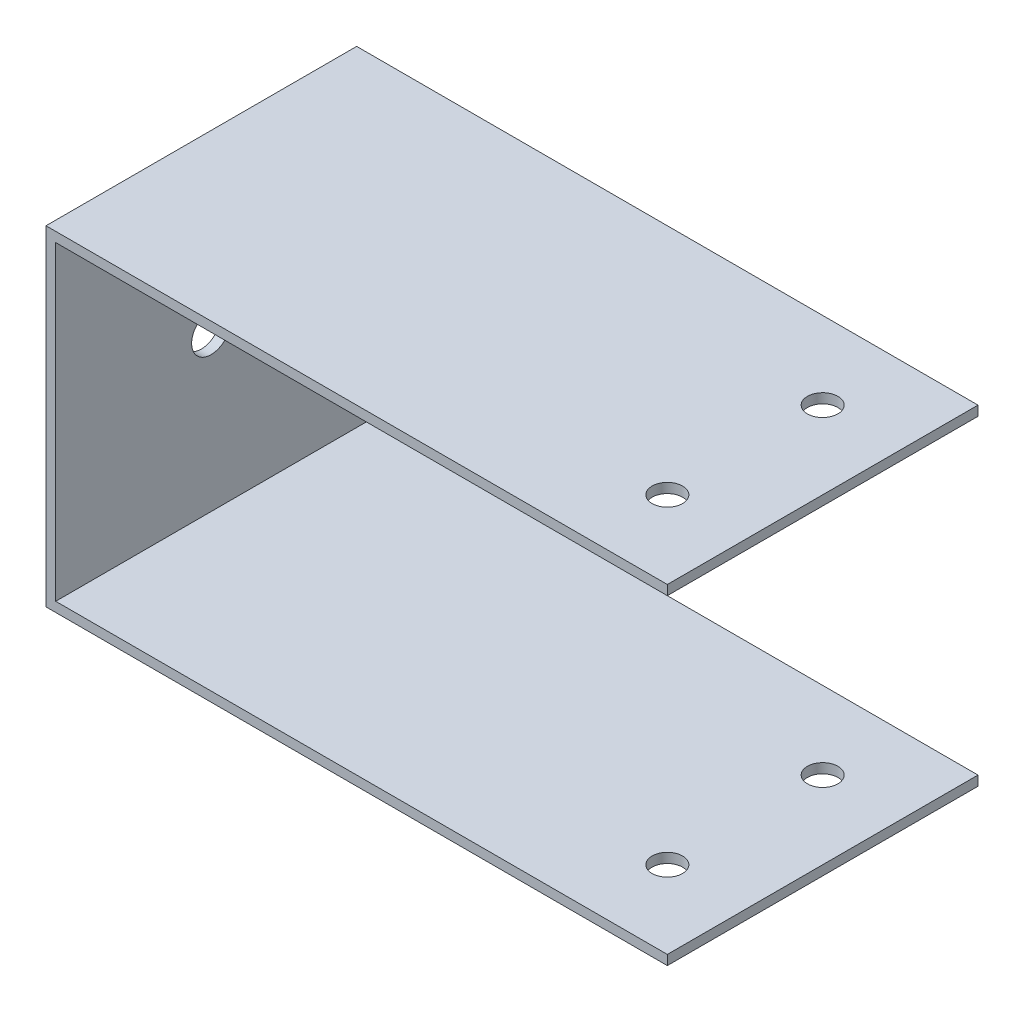
ISO-10303-21;
HEADER;
FILE_DESCRIPTION(('STEP AP214'),'2;1');
FILE_NAME('part.step','',(''),(''),'','','');
FILE_SCHEMA(('AUTOMOTIVE_DESIGN { 1 0 10303 214 1 1 1 1 }'));
ENDSEC;
DATA;
#1=APPLICATION_CONTEXT('core data for automotive mechanical design processes');
#2=APPLICATION_PROTOCOL_DEFINITION('international standard','automotive_design',2000,#1);
#3=PRODUCT_CONTEXT('',#1,'mechanical');
#4=PRODUCT('Part','Part','',(#3));
#5=PRODUCT_RELATED_PRODUCT_CATEGORY('part','',(#4));
#6=PRODUCT_DEFINITION_FORMATION('','',#4);
#7=PRODUCT_DEFINITION_CONTEXT('part definition',#1,'design');
#8=PRODUCT_DEFINITION('design','',#6,#7);
#9=PRODUCT_DEFINITION_SHAPE('','',#8);
#10=(LENGTH_UNIT() NAMED_UNIT(*) SI_UNIT(.MILLI.,.METRE.));
#11=(NAMED_UNIT(*) PLANE_ANGLE_UNIT() SI_UNIT($,.RADIAN.));
#12=(NAMED_UNIT(*) SI_UNIT($,.STERADIAN.) SOLID_ANGLE_UNIT());
#13=UNCERTAINTY_MEASURE_WITH_UNIT(LENGTH_MEASURE(1.E-05),#10,'distance_accuracy_value','');
#14=(GEOMETRIC_REPRESENTATION_CONTEXT(3) GLOBAL_UNCERTAINTY_ASSIGNED_CONTEXT((#13)) GLOBAL_UNIT_ASSIGNED_CONTEXT((#10,
#11,#12)) REPRESENTATION_CONTEXT('',''));
#15=CARTESIAN_POINT('',(0.,0.,0.));
#16=DIRECTION('',(0.,0.,1.));
#17=DIRECTION('',(1.,0.,0.));
#18=AXIS2_PLACEMENT_3D('',#15,#16,#17);
#19=CARTESIAN_POINT('',(0.,0.,50.8));
#20=DIRECTION('',(-1.,0.,0.));
#21=DIRECTION('',(0.,0.,1.));
#22=AXIS2_PLACEMENT_3D('',#19,#20,#21);
#23=PLANE('',#22);
#24=CARTESIAN_POINT('',(0.,25.4,25.4));
#25=DIRECTION('',(1.,0.,0.));
#26=DIRECTION('',(0.,0.,-1.));
#27=AXIS2_PLACEMENT_3D('',#24,#25,#26);
#28=CIRCLE('',#27,3.175);
#29=CARTESIAN_POINT('',(0.,25.4,22.225));
#30=VERTEX_POINT('',#29);
#31=EDGE_CURVE('E177',#30,#30,#28,.T.);
#32=ORIENTED_EDGE('',*,*,#31,.F.);
#33=EDGE_LOOP('',(#32));
#34=FACE_BOUND('',#33,.T.);
#35=DIRECTION('',(0.,1.,0.));
#36=VECTOR('',#35,1.);
#37=CARTESIAN_POINT('',(0.,0.,0.));
#38=LINE('',#37,#36);
#39=CARTESIAN_POINT('',(0.,0.,0.));
#40=VERTEX_POINT('',#39);
#41=CARTESIAN_POINT('',(0.,50.8,0.));
#42=VERTEX_POINT('',#41);
#43=EDGE_CURVE('E134',#40,#42,#38,.T.);
#44=ORIENTED_EDGE('',*,*,#43,.T.);
#45=DIRECTION('',(0.,0.,-1.));
#46=VECTOR('',#45,1.);
#47=CARTESIAN_POINT('',(0.,50.8,50.8));
#48=LINE('',#47,#46);
#49=CARTESIAN_POINT('',(0.,50.8,50.8));
#50=VERTEX_POINT('',#49);
#51=EDGE_CURVE('E11',#50,#42,#48,.T.);
#52=ORIENTED_EDGE('',*,*,#51,.F.);
#53=DIRECTION('',(0.,1.,0.));
#54=VECTOR('',#53,1.);
#55=CARTESIAN_POINT('',(0.,0.,50.8));
#56=LINE('',#55,#54);
#57=CARTESIAN_POINT('',(0.,0.,50.8));
#58=VERTEX_POINT('',#57);
#59=EDGE_CURVE('E149',#58,#50,#56,.T.);
#60=ORIENTED_EDGE('',*,*,#59,.F.);
#61=DIRECTION('',(0.,0.,-1.));
#62=VECTOR('',#61,1.);
#63=CARTESIAN_POINT('',(0.,0.,50.8));
#64=LINE('',#63,#62);
#65=EDGE_CURVE('E130',#58,#40,#64,.T.);
#66=ORIENTED_EDGE('',*,*,#65,.T.);
#67=EDGE_LOOP('',(#44,#52,#60,#66));
#68=FACE_BOUND('',#67,.T.);
#69=ADVANCED_FACE('F36',(#34,#68),#23,.F.);
#70=CARTESIAN_POINT('',(0.,50.8,50.8));
#71=DIRECTION('',(0.,1.,0.));
#72=DIRECTION('',(0.,0.,1.));
#73=AXIS2_PLACEMENT_3D('',#70,#71,#72);
#74=PLANE('',#73);
#75=CARTESIAN_POINT('',(87.3125,50.8,38.1));
#76=DIRECTION('',(0.,1.,0.));
#77=DIRECTION('',(0.,0.,1.));
#78=AXIS2_PLACEMENT_3D('',#75,#76,#77);
#79=CIRCLE('',#78,2.4892);
#80=CARTESIAN_POINT('',(87.3125,50.8,40.5892));
#81=VERTEX_POINT('',#80);
#82=EDGE_CURVE('E138',#81,#81,#79,.T.);
#83=ORIENTED_EDGE('',*,*,#82,.T.);
#84=EDGE_LOOP('',(#83));
#85=FACE_BOUND('',#84,.T.);
#86=CARTESIAN_POINT('',(87.3125,50.8,12.7));
#87=DIRECTION('',(0.,1.,0.));
#88=DIRECTION('',(0.,0.,1.));
#89=AXIS2_PLACEMENT_3D('',#86,#87,#88);
#90=CIRCLE('',#89,2.4892);
#91=CARTESIAN_POINT('',(87.3125,50.8,15.1892));
#92=VERTEX_POINT('',#91);
#93=EDGE_CURVE('E162',#92,#92,#90,.T.);
#94=ORIENTED_EDGE('',*,*,#93,.T.);
#95=EDGE_LOOP('',(#94));
#96=FACE_BOUND('',#95,.T.);
#97=DIRECTION('',(1.,0.,0.));
#98=VECTOR('',#97,1.);
#99=CARTESIAN_POINT('',(0.,50.8,0.));
#100=LINE('',#99,#98);
#101=CARTESIAN_POINT('',(100.0125,50.8,0.));
#102=VERTEX_POINT('',#101);
#103=EDGE_CURVE('E137',#42,#102,#100,.T.);
#104=ORIENTED_EDGE('',*,*,#103,.T.);
#105=DIRECTION('',(0.,0.,-1.));
#106=VECTOR('',#105,1.);
#107=CARTESIAN_POINT('',(100.0125,50.8,50.8));
#108=LINE('',#107,#106);
#109=CARTESIAN_POINT('',(100.0125,50.8,50.8));
#110=VERTEX_POINT('',#109);
#111=EDGE_CURVE('E45',#110,#102,#108,.T.);
#112=ORIENTED_EDGE('',*,*,#111,.F.);
#113=DIRECTION('',(1.,0.,0.));
#114=VECTOR('',#113,1.);
#115=CARTESIAN_POINT('',(0.,50.8,50.8));
#116=LINE('',#115,#114);
#117=EDGE_CURVE('E97',#50,#110,#116,.T.);
#118=ORIENTED_EDGE('',*,*,#117,.F.);
#119=ORIENTED_EDGE('',*,*,#51,.T.);
#120=EDGE_LOOP('',(#104,#112,#118,#119));
#121=FACE_BOUND('',#120,.T.);
#122=ADVANCED_FACE('F223',(#85,#96,#121),#74,.F.);
#123=CARTESIAN_POINT('',(100.0125,50.8,50.8));
#124=DIRECTION('',(-1.,0.,0.));
#125=DIRECTION('',(0.,0.,1.));
#126=AXIS2_PLACEMENT_3D('',#123,#124,#125);
#127=PLANE('',#126);
#128=DIRECTION('',(0.,1.,0.));
#129=VECTOR('',#128,1.);
#130=CARTESIAN_POINT('',(100.0125,50.8,0.));
#131=LINE('',#130,#129);
#132=CARTESIAN_POINT('',(100.0125,52.3875,0.));
#133=VERTEX_POINT('',#132);
#134=EDGE_CURVE('E140',#102,#133,#131,.T.);
#135=ORIENTED_EDGE('',*,*,#134,.T.);
#136=DIRECTION('',(0.,0.,-1.));
#137=VECTOR('',#136,1.);
#138=CARTESIAN_POINT('',(100.0125,52.3875,50.8));
#139=LINE('',#138,#137);
#140=CARTESIAN_POINT('',(100.0125,52.3875,50.8));
#141=VERTEX_POINT('',#140);
#142=EDGE_CURVE('E156',#141,#133,#139,.T.);
#143=ORIENTED_EDGE('',*,*,#142,.F.);
#144=DIRECTION('',(0.,1.,0.));
#145=VECTOR('',#144,1.);
#146=CARTESIAN_POINT('',(100.0125,50.8,50.8));
#147=LINE('',#146,#145);
#148=EDGE_CURVE('E190',#110,#141,#147,.T.);
#149=ORIENTED_EDGE('',*,*,#148,.F.);
#150=ORIENTED_EDGE('',*,*,#111,.T.);
#151=EDGE_LOOP('',(#135,#143,#149,#150));
#152=FACE_BOUND('',#151,.T.);
#153=ADVANCED_FACE('F228',(#152),#127,.F.);
#154=CARTESIAN_POINT('',(-1.5875,52.3875,50.8));
#155=DIRECTION('',(0.,-1.,0.));
#156=DIRECTION('',(0.,0.,-1.));
#157=AXIS2_PLACEMENT_3D('',#154,#155,#156);
#158=PLANE('',#157);
#159=CARTESIAN_POINT('',(87.3125,52.3875,38.1));
#160=DIRECTION('',(0.,1.,0.));
#161=DIRECTION('',(0.,0.,1.));
#162=AXIS2_PLACEMENT_3D('',#159,#160,#161);
#163=CIRCLE('',#162,2.4892);
#164=CARTESIAN_POINT('',(87.3125,52.3875,40.5892));
#165=VERTEX_POINT('',#164);
#166=EDGE_CURVE('E169',#165,#165,#163,.T.);
#167=ORIENTED_EDGE('',*,*,#166,.F.);
#168=EDGE_LOOP('',(#167));
#169=FACE_BOUND('',#168,.T.);
#170=CARTESIAN_POINT('',(87.3125,52.3875,12.7));
#171=DIRECTION('',(0.,1.,0.));
#172=DIRECTION('',(0.,0.,1.));
#173=AXIS2_PLACEMENT_3D('',#170,#171,#172);
#174=CIRCLE('',#173,2.4892);
#175=CARTESIAN_POINT('',(87.3125,52.3875,15.1892));
#176=VERTEX_POINT('',#175);
#177=EDGE_CURVE('E182',#176,#176,#174,.T.);
#178=ORIENTED_EDGE('',*,*,#177,.F.);
#179=EDGE_LOOP('',(#178));
#180=FACE_BOUND('',#179,.T.);
#181=DIRECTION('',(-1.,0.,0.));
#182=VECTOR('',#181,1.);
#183=CARTESIAN_POINT('',(-1.5875,52.3875,0.));
#184=LINE('',#183,#182);
#185=CARTESIAN_POINT('',(-1.5875,52.3875,0.));
#186=VERTEX_POINT('',#185);
#187=EDGE_CURVE('E142',#133,#186,#184,.T.);
#188=ORIENTED_EDGE('',*,*,#187,.T.);
#189=DIRECTION('',(0.,0.,-1.));
#190=VECTOR('',#189,1.);
#191=CARTESIAN_POINT('',(-1.5875,52.3875,50.8));
#192=LINE('',#191,#190);
#193=CARTESIAN_POINT('',(-1.5875,52.3875,50.8));
#194=VERTEX_POINT('',#193);
#195=EDGE_CURVE('E153',#194,#186,#192,.T.);
#196=ORIENTED_EDGE('',*,*,#195,.F.);
#197=DIRECTION('',(-1.,0.,0.));
#198=VECTOR('',#197,1.);
#199=CARTESIAN_POINT('',(-1.5875,52.3875,50.8));
#200=LINE('',#199,#198);
#201=EDGE_CURVE('E192',#141,#194,#200,.T.);
#202=ORIENTED_EDGE('',*,*,#201,.F.);
#203=ORIENTED_EDGE('',*,*,#142,.T.);
#204=EDGE_LOOP('',(#188,#196,#202,#203));
#205=FACE_BOUND('',#204,.T.);
#206=ADVANCED_FACE('F198',(#169,#180,#205),#158,.F.);
#207=CARTESIAN_POINT('',(-1.5875,-1.5875,50.8));
#208=DIRECTION('',(1.,0.,0.));
#209=DIRECTION('',(0.,0.,-1.));
#210=AXIS2_PLACEMENT_3D('',#207,#208,#209);
#211=PLANE('',#210);
#212=CARTESIAN_POINT('',(-1.5875,25.4,25.4));
#213=DIRECTION('',(1.,0.,0.));
#214=DIRECTION('',(0.,0.,-1.));
#215=AXIS2_PLACEMENT_3D('',#212,#213,#214);
#216=CIRCLE('',#215,3.175);
#217=CARTESIAN_POINT('',(-1.5875,25.4,22.225));
#218=VERTEX_POINT('',#217);
#219=EDGE_CURVE('E184',#218,#218,#216,.T.);
#220=ORIENTED_EDGE('',*,*,#219,.T.);
#221=EDGE_LOOP('',(#220));
#222=FACE_BOUND('',#221,.T.);
#223=DIRECTION('',(0.,-1.,0.));
#224=VECTOR('',#223,1.);
#225=CARTESIAN_POINT('',(-1.5875,-1.5875,0.));
#226=LINE('',#225,#224);
#227=CARTESIAN_POINT('',(-1.5875,-1.5875,0.));
#228=VERTEX_POINT('',#227);
#229=EDGE_CURVE('E144',#186,#228,#226,.T.);
#230=ORIENTED_EDGE('',*,*,#229,.T.);
#231=DIRECTION('',(0.,0.,-1.));
#232=VECTOR('',#231,1.);
#233=CARTESIAN_POINT('',(-1.5875,-1.5875,50.8));
#234=LINE('',#233,#232);
#235=CARTESIAN_POINT('',(-1.5875,-1.5875,50.8));
#236=VERTEX_POINT('',#235);
#237=EDGE_CURVE('E125',#236,#228,#234,.T.);
#238=ORIENTED_EDGE('',*,*,#237,.F.);
#239=DIRECTION('',(0.,-1.,0.));
#240=VECTOR('',#239,1.);
#241=CARTESIAN_POINT('',(-1.5875,-1.5875,50.8));
#242=LINE('',#241,#240);
#243=EDGE_CURVE('E116',#194,#236,#242,.T.);
#244=ORIENTED_EDGE('',*,*,#243,.F.);
#245=ORIENTED_EDGE('',*,*,#195,.T.);
#246=EDGE_LOOP('',(#230,#238,#244,#245));
#247=FACE_BOUND('',#246,.T.);
#248=ADVANCED_FACE('F202',(#222,#247),#211,.F.);
#249=CARTESIAN_POINT('',(-1.5875,-1.5875,50.8));
#250=DIRECTION('',(0.,1.,0.));
#251=DIRECTION('',(0.,0.,1.));
#252=AXIS2_PLACEMENT_3D('',#249,#250,#251);
#253=PLANE('',#252);
#254=CARTESIAN_POINT('',(87.3125,-1.5875,38.1));
#255=DIRECTION('',(0.,1.,0.));
#256=DIRECTION('',(0.,0.,1.));
#257=AXIS2_PLACEMENT_3D('',#254,#255,#256);
#258=CIRCLE('',#257,2.4892);
#259=CARTESIAN_POINT('',(87.3125,-1.5875,40.5892));
#260=VERTEX_POINT('',#259);
#261=EDGE_CURVE('E163',#260,#260,#258,.T.);
#262=ORIENTED_EDGE('',*,*,#261,.T.);
#263=EDGE_LOOP('',(#262));
#264=FACE_BOUND('',#263,.T.);
#265=CARTESIAN_POINT('',(87.3125,-1.5875,12.7));
#266=DIRECTION('',(0.,1.,0.));
#267=DIRECTION('',(0.,0.,1.));
#268=AXIS2_PLACEMENT_3D('',#265,#266,#267);
#269=CIRCLE('',#268,2.4892);
#270=CARTESIAN_POINT('',(87.3125,-1.5875,15.1892));
#271=VERTEX_POINT('',#270);
#272=EDGE_CURVE('E174',#271,#271,#269,.T.);
#273=ORIENTED_EDGE('',*,*,#272,.T.);
#274=EDGE_LOOP('',(#273));
#275=FACE_BOUND('',#274,.T.);
#276=DIRECTION('',(1.,0.,0.));
#277=VECTOR('',#276,1.);
#278=CARTESIAN_POINT('',(-1.5875,-1.5875,0.));
#279=LINE('',#278,#277);
#280=CARTESIAN_POINT('',(100.0125,-1.5875,0.));
#281=VERTEX_POINT('',#280);
#282=EDGE_CURVE('E124',#228,#281,#279,.T.);
#283=ORIENTED_EDGE('',*,*,#282,.T.);
#284=DIRECTION('',(0.,0.,-1.));
#285=VECTOR('',#284,1.);
#286=CARTESIAN_POINT('',(100.0125,-1.5875,50.8));
#287=LINE('',#286,#285);
#288=CARTESIAN_POINT('',(100.0125,-1.5875,50.8));
#289=VERTEX_POINT('',#288);
#290=EDGE_CURVE('E121',#289,#281,#287,.T.);
#291=ORIENTED_EDGE('',*,*,#290,.F.);
#292=DIRECTION('',(1.,0.,0.));
#293=VECTOR('',#292,1.);
#294=CARTESIAN_POINT('',(-1.5875,-1.5875,50.8));
#295=LINE('',#294,#293);
#296=EDGE_CURVE('E110',#236,#289,#295,.T.);
#297=ORIENTED_EDGE('',*,*,#296,.F.);
#298=ORIENTED_EDGE('',*,*,#237,.T.);
#299=EDGE_LOOP('',(#283,#291,#297,#298));
#300=FACE_BOUND('',#299,.T.);
#301=ADVANCED_FACE('F122',(#264,#275,#300),#253,.F.);
#302=CARTESIAN_POINT('',(100.0125,-1.5875,50.8));
#303=DIRECTION('',(-1.,0.,0.));
#304=DIRECTION('',(0.,0.,1.));
#305=AXIS2_PLACEMENT_3D('',#302,#303,#304);
#306=PLANE('',#305);
#307=DIRECTION('',(0.,1.,0.));
#308=VECTOR('',#307,1.);
#309=CARTESIAN_POINT('',(100.0125,-1.5875,0.));
#310=LINE('',#309,#308);
#311=CARTESIAN_POINT('',(100.0125,0.,0.));
#312=VERTEX_POINT('',#311);
#313=EDGE_CURVE('E83',#281,#312,#310,.T.);
#314=ORIENTED_EDGE('',*,*,#313,.T.);
#315=DIRECTION('',(0.,0.,-1.));
#316=VECTOR('',#315,1.);
#317=CARTESIAN_POINT('',(100.0125,0.,50.8));
#318=LINE('',#317,#316);
#319=CARTESIAN_POINT('',(100.0125,0.,50.8));
#320=VERTEX_POINT('',#319);
#321=EDGE_CURVE('E126',#320,#312,#318,.T.);
#322=ORIENTED_EDGE('',*,*,#321,.F.);
#323=DIRECTION('',(0.,1.,0.));
#324=VECTOR('',#323,1.);
#325=CARTESIAN_POINT('',(100.0125,-1.5875,50.8));
#326=LINE('',#325,#324);
#327=EDGE_CURVE('E114',#289,#320,#326,.T.);
#328=ORIENTED_EDGE('',*,*,#327,.F.);
#329=ORIENTED_EDGE('',*,*,#290,.T.);
#330=EDGE_LOOP('',(#314,#322,#328,#329));
#331=FACE_BOUND('',#330,.T.);
#332=ADVANCED_FACE('F128',(#331),#306,.F.);
#333=CARTESIAN_POINT('',(0.,0.,50.8));
#334=DIRECTION('',(0.,-1.,0.));
#335=DIRECTION('',(0.,0.,-1.));
#336=AXIS2_PLACEMENT_3D('',#333,#334,#335);
#337=PLANE('',#336);
#338=CARTESIAN_POINT('',(87.3125,0.,38.1));
#339=DIRECTION('',(0.,-1.,0.));
#340=DIRECTION('',(0.,0.,-1.));
#341=AXIS2_PLACEMENT_3D('',#338,#339,#340);
#342=CIRCLE('',#341,2.4892);
#343=CARTESIAN_POINT('',(87.3125,0.,35.6108));
#344=VERTEX_POINT('',#343);
#345=EDGE_CURVE('E39',#344,#344,#342,.T.);
#346=ORIENTED_EDGE('',*,*,#345,.T.);
#347=EDGE_LOOP('',(#346));
#348=FACE_BOUND('',#347,.T.);
#349=CARTESIAN_POINT('',(87.3125,0.,12.7));
#350=DIRECTION('',(0.,-1.,0.));
#351=DIRECTION('',(0.,0.,-1.));
#352=AXIS2_PLACEMENT_3D('',#349,#350,#351);
#353=CIRCLE('',#352,2.4892);
#354=CARTESIAN_POINT('',(87.3125,0.,10.2108));
#355=VERTEX_POINT('',#354);
#356=EDGE_CURVE('E160',#355,#355,#353,.T.);
#357=ORIENTED_EDGE('',*,*,#356,.T.);
#358=EDGE_LOOP('',(#357));
#359=FACE_BOUND('',#358,.T.);
#360=DIRECTION('',(-1.,0.,0.));
#361=VECTOR('',#360,1.);
#362=CARTESIAN_POINT('',(0.,0.,0.));
#363=LINE('',#362,#361);
#364=EDGE_CURVE('E89',#312,#40,#363,.T.);
#365=ORIENTED_EDGE('',*,*,#364,.T.);
#366=ORIENTED_EDGE('',*,*,#65,.F.);
#367=DIRECTION('',(-1.,0.,0.));
#368=VECTOR('',#367,1.);
#369=CARTESIAN_POINT('',(0.,0.,50.8));
#370=LINE('',#369,#368);
#371=EDGE_CURVE('E54',#320,#58,#370,.T.);
#372=ORIENTED_EDGE('',*,*,#371,.F.);
#373=ORIENTED_EDGE('',*,*,#321,.T.);
#374=EDGE_LOOP('',(#365,#366,#372,#373));
#375=FACE_BOUND('',#374,.T.);
#376=ADVANCED_FACE('F210',(#348,#359,#375),#337,.F.);
#377=CARTESIAN_POINT('',(0.,0.,50.8));
#378=DIRECTION('',(0.,0.,-1.));
#379=DIRECTION('',(-1.,0.,0.));
#380=AXIS2_PLACEMENT_3D('',#377,#378,#379);
#381=PLANE('',#380);
#382=ORIENTED_EDGE('',*,*,#59,.T.);
#383=ORIENTED_EDGE('',*,*,#117,.T.);
#384=ORIENTED_EDGE('',*,*,#148,.T.);
#385=ORIENTED_EDGE('',*,*,#201,.T.);
#386=ORIENTED_EDGE('',*,*,#243,.T.);
#387=ORIENTED_EDGE('',*,*,#296,.T.);
#388=ORIENTED_EDGE('',*,*,#327,.T.);
#389=ORIENTED_EDGE('',*,*,#371,.T.);
#390=EDGE_LOOP('',(#382,#383,#384,#385,#386,#387,#388,#389));
#391=FACE_BOUND('',#390,.T.);
#392=ADVANCED_FACE('F112',(#391),#381,.F.);
#393=CARTESIAN_POINT('',(0.,0.,0.));
#394=DIRECTION('',(0.,0.,-1.));
#395=DIRECTION('',(-1.,0.,0.));
#396=AXIS2_PLACEMENT_3D('',#393,#394,#395);
#397=PLANE('',#396);
#398=ORIENTED_EDGE('',*,*,#43,.F.);
#399=ORIENTED_EDGE('',*,*,#364,.F.);
#400=ORIENTED_EDGE('',*,*,#313,.F.);
#401=ORIENTED_EDGE('',*,*,#282,.F.);
#402=ORIENTED_EDGE('',*,*,#229,.F.);
#403=ORIENTED_EDGE('',*,*,#187,.F.);
#404=ORIENTED_EDGE('',*,*,#134,.F.);
#405=ORIENTED_EDGE('',*,*,#103,.F.);
#406=EDGE_LOOP('',(#398,#399,#400,#401,#402,#403,#404,#405));
#407=FACE_BOUND('',#406,.T.);
#408=ADVANCED_FACE('F205',(#407),#397,.T.);
#409=CARTESIAN_POINT('',(87.3125,-1.5875,12.7));
#410=DIRECTION('',(0.,1.,0.));
#411=DIRECTION('',(0.,0.,1.));
#412=AXIS2_PLACEMENT_3D('',#409,#410,#411);
#413=CYLINDRICAL_SURFACE('',#412,2.4892);
#414=ORIENTED_EDGE('',*,*,#272,.F.);
#415=EDGE_LOOP('',(#414));
#416=FACE_BOUND('',#415,.T.);
#417=ORIENTED_EDGE('',*,*,#356,.F.);
#418=EDGE_LOOP('',(#417));
#419=FACE_BOUND('',#418,.T.);
#420=ADVANCED_FACE('F251',(#416,#419),#413,.F.);
#421=CARTESIAN_POINT('',(87.3125,-1.5875,38.1));
#422=DIRECTION('',(0.,1.,0.));
#423=DIRECTION('',(0.,0.,1.));
#424=AXIS2_PLACEMENT_3D('',#421,#422,#423);
#425=CYLINDRICAL_SURFACE('',#424,2.4892);
#426=ORIENTED_EDGE('',*,*,#261,.F.);
#427=EDGE_LOOP('',(#426));
#428=FACE_BOUND('',#427,.T.);
#429=ORIENTED_EDGE('',*,*,#345,.F.);
#430=EDGE_LOOP('',(#429));
#431=FACE_BOUND('',#430,.T.);
#432=ADVANCED_FACE('F247',(#428,#431),#425,.F.);
#433=ORIENTED_EDGE('',*,*,#177,.T.);
#434=EDGE_LOOP('',(#433));
#435=FACE_BOUND('',#434,.T.);
#436=ORIENTED_EDGE('',*,*,#93,.F.);
#437=EDGE_LOOP('',(#436));
#438=FACE_BOUND('',#437,.T.);
#439=ADVANCED_FACE('F244',(#435,#438),#413,.F.);
#440=ORIENTED_EDGE('',*,*,#166,.T.);
#441=EDGE_LOOP('',(#440));
#442=FACE_BOUND('',#441,.T.);
#443=ORIENTED_EDGE('',*,*,#82,.F.);
#444=EDGE_LOOP('',(#443));
#445=FACE_BOUND('',#444,.T.);
#446=ADVANCED_FACE('F239',(#442,#445),#425,.F.);
#447=CARTESIAN_POINT('',(-1.5875,25.4,25.4));
#448=DIRECTION('',(1.,0.,0.));
#449=DIRECTION('',(0.,0.,-1.));
#450=AXIS2_PLACEMENT_3D('',#447,#448,#449);
#451=CYLINDRICAL_SURFACE('',#450,3.175);
#452=ORIENTED_EDGE('',*,*,#219,.F.);
#453=EDGE_LOOP('',(#452));
#454=FACE_BOUND('',#453,.T.);
#455=ORIENTED_EDGE('',*,*,#31,.T.);
#456=EDGE_LOOP('',(#455));
#457=FACE_BOUND('',#456,.T.);
#458=ADVANCED_FACE('F237',(#454,#457),#451,.F.);
#459=CLOSED_SHELL('',(#69,#122,#153,#206,#248,#301,#332,#376,#392,#408,#420,#432,#439,#446,#458));
#460=MANIFOLD_SOLID_BREP('B2',#459);
#461=ADVANCED_BREP_SHAPE_REPRESENTATION('',(#18,#460),#14);
#462=SHAPE_DEFINITION_REPRESENTATION(#9,#461);
ENDSEC;
END-ISO-10303-21;
